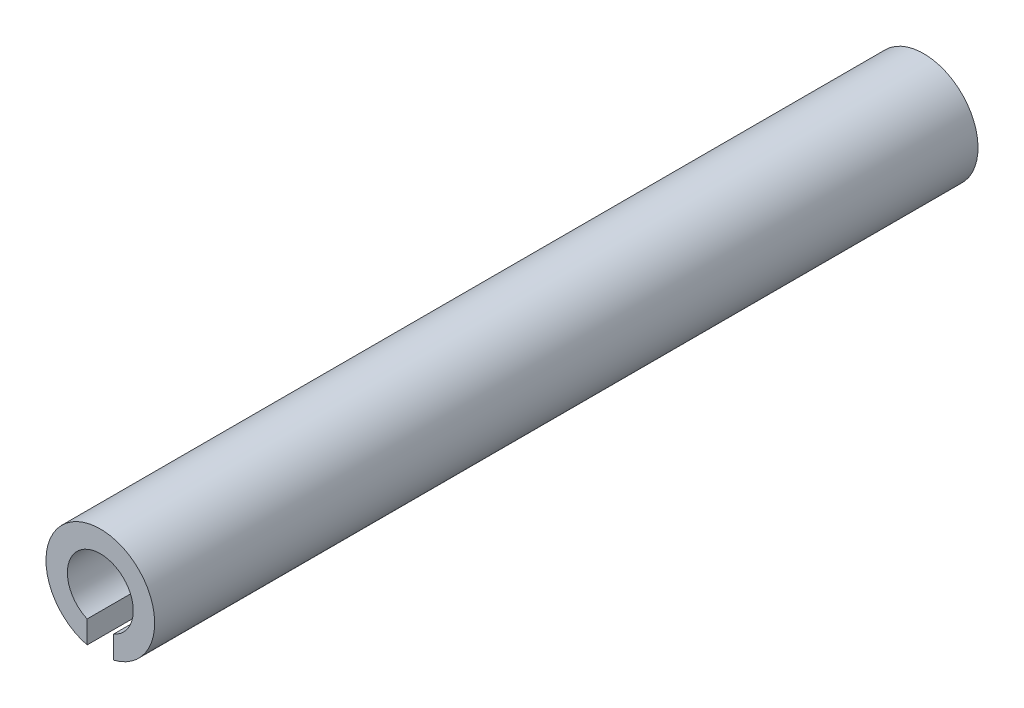
ISO-10303-21;
HEADER;
FILE_DESCRIPTION(('STEP AP214'),'2;1');
FILE_NAME('part.step','',(''),(''),'','','');
FILE_SCHEMA(('AUTOMOTIVE_DESIGN { 1 0 10303 214 1 1 1 1 }'));
ENDSEC;
DATA;
#1=APPLICATION_CONTEXT('core data for automotive mechanical design processes');
#2=APPLICATION_PROTOCOL_DEFINITION('international standard','automotive_design',2000,#1);
#3=PRODUCT_CONTEXT('',#1,'mechanical');
#4=PRODUCT('Part','Part','',(#3));
#5=PRODUCT_RELATED_PRODUCT_CATEGORY('part','',(#4));
#6=PRODUCT_DEFINITION_FORMATION('','',#4);
#7=PRODUCT_DEFINITION_CONTEXT('part definition',#1,'design');
#8=PRODUCT_DEFINITION('design','',#6,#7);
#9=PRODUCT_DEFINITION_SHAPE('','',#8);
#10=(LENGTH_UNIT() NAMED_UNIT(*) SI_UNIT(.MILLI.,.METRE.));
#11=(NAMED_UNIT(*) PLANE_ANGLE_UNIT() SI_UNIT($,.RADIAN.));
#12=(NAMED_UNIT(*) SI_UNIT($,.STERADIAN.) SOLID_ANGLE_UNIT());
#13=UNCERTAINTY_MEASURE_WITH_UNIT(LENGTH_MEASURE(1.E-05),#10,'distance_accuracy_value','');
#14=(GEOMETRIC_REPRESENTATION_CONTEXT(3) GLOBAL_UNCERTAINTY_ASSIGNED_CONTEXT((#13)) GLOBAL_UNIT_ASSIGNED_CONTEXT((#10,
#11,#12)) REPRESENTATION_CONTEXT('',''));
#15=CARTESIAN_POINT('',(0.,0.,0.));
#16=DIRECTION('',(0.,0.,1.));
#17=DIRECTION('',(1.,0.,0.));
#18=AXIS2_PLACEMENT_3D('',#15,#16,#17);
#19=CARTESIAN_POINT('',(0.,0.,25.));
#20=DIRECTION('',(0.,0.,-1.));
#21=DIRECTION('',(-1.,0.,0.));
#22=AXIS2_PLACEMENT_3D('',#19,#20,#21);
#23=CYLINDRICAL_SURFACE('',#22,1.);
#24=CARTESIAN_POINT('',(0.,0.,0.));
#25=DIRECTION('',(0.,0.,1.));
#26=DIRECTION('',(1.,0.,0.));
#27=AXIS2_PLACEMENT_3D('',#24,#25,#26);
#28=CIRCLE('',#27,1.);
#29=CARTESIAN_POINT('',(0.4,-0.916515138991168,0.));
#30=VERTEX_POINT('',#29);
#31=CARTESIAN_POINT('',(-0.4,-0.916515138991168,0.));
#32=VERTEX_POINT('',#31);
#33=EDGE_CURVE('E113',#30,#32,#28,.T.);
#34=ORIENTED_EDGE('',*,*,#33,.F.);
#35=DIRECTION('',(0.,0.,-1.));
#36=VECTOR('',#35,1.);
#37=CARTESIAN_POINT('',(0.4,-0.916515138991168,25.));
#38=LINE('',#37,#36);
#39=CARTESIAN_POINT('',(0.4,-0.916515138991168,25.));
#40=VERTEX_POINT('',#39);
#41=EDGE_CURVE('E11',#40,#30,#38,.T.);
#42=ORIENTED_EDGE('',*,*,#41,.F.);
#43=CARTESIAN_POINT('',(0.,0.,25.));
#44=DIRECTION('',(0.,0.,1.));
#45=DIRECTION('',(1.,0.,0.));
#46=AXIS2_PLACEMENT_3D('',#43,#44,#45);
#47=CIRCLE('',#46,1.);
#48=CARTESIAN_POINT('',(-0.4,-0.916515138991168,25.));
#49=VERTEX_POINT('',#48);
#50=EDGE_CURVE('E94',#40,#49,#47,.T.);
#51=ORIENTED_EDGE('',*,*,#50,.T.);
#52=DIRECTION('',(0.,0.,-1.));
#53=VECTOR('',#52,1.);
#54=CARTESIAN_POINT('',(-0.4,-0.916515138991168,25.));
#55=LINE('',#54,#53);
#56=EDGE_CURVE('E62',#49,#32,#55,.T.);
#57=ORIENTED_EDGE('',*,*,#56,.T.);
#58=EDGE_LOOP('',(#34,#42,#51,#57));
#59=FACE_BOUND('',#58,.T.);
#60=ADVANCED_FACE('F45',(#59),#23,.F.);
#61=CARTESIAN_POINT('',(0.4,0.,25.));
#62=DIRECTION('',(1.,0.,0.));
#63=DIRECTION('',(0.,1.,0.));
#64=AXIS2_PLACEMENT_3D('',#61,#62,#63);
#65=PLANE('',#64);
#66=DIRECTION('',(0.,-1.,0.));
#67=VECTOR('',#66,1.);
#68=CARTESIAN_POINT('',(0.4,0.,0.));
#69=LINE('',#68,#67);
#70=CARTESIAN_POINT('',(0.4,-1.60078105935821,0.));
#71=VERTEX_POINT('',#70);
#72=EDGE_CURVE('E101',#30,#71,#69,.T.);
#73=ORIENTED_EDGE('',*,*,#72,.T.);
#74=DIRECTION('',(0.,0.,-1.));
#75=VECTOR('',#74,1.);
#76=CARTESIAN_POINT('',(0.4,-1.60078105935821,25.));
#77=LINE('',#76,#75);
#78=CARTESIAN_POINT('',(0.4,-1.60078105935821,25.));
#79=VERTEX_POINT('',#78);
#80=EDGE_CURVE('E54',#79,#71,#77,.T.);
#81=ORIENTED_EDGE('',*,*,#80,.F.);
#82=DIRECTION('',(0.,-1.,0.));
#83=VECTOR('',#82,1.);
#84=CARTESIAN_POINT('',(0.4,0.,25.));
#85=LINE('',#84,#83);
#86=EDGE_CURVE('E88',#40,#79,#85,.T.);
#87=ORIENTED_EDGE('',*,*,#86,.F.);
#88=ORIENTED_EDGE('',*,*,#41,.T.);
#89=EDGE_LOOP('',(#73,#81,#87,#88));
#90=FACE_BOUND('',#89,.T.);
#91=ADVANCED_FACE('F99',(#90),#65,.F.);
#92=CARTESIAN_POINT('',(0.,0.,25.));
#93=DIRECTION('',(0.,0.,-1.));
#94=DIRECTION('',(-1.,0.,0.));
#95=AXIS2_PLACEMENT_3D('',#92,#93,#94);
#96=CYLINDRICAL_SURFACE('',#95,1.65);
#97=CARTESIAN_POINT('',(0.,0.,0.));
#98=DIRECTION('',(0.,0.,1.));
#99=DIRECTION('',(1.,0.,0.));
#100=AXIS2_PLACEMENT_3D('',#97,#98,#99);
#101=CIRCLE('',#100,1.65);
#102=CARTESIAN_POINT('',(-0.4,-1.60078105935821,0.));
#103=VERTEX_POINT('',#102);
#104=EDGE_CURVE('E118',#71,#103,#101,.T.);
#105=ORIENTED_EDGE('',*,*,#104,.T.);
#106=DIRECTION('',(0.,0.,-1.));
#107=VECTOR('',#106,1.);
#108=CARTESIAN_POINT('',(-0.4,-1.60078105935821,25.));
#109=LINE('',#108,#107);
#110=CARTESIAN_POINT('',(-0.4,-1.60078105935821,25.));
#111=VERTEX_POINT('',#110);
#112=EDGE_CURVE('E76',#111,#103,#109,.T.);
#113=ORIENTED_EDGE('',*,*,#112,.F.);
#114=CARTESIAN_POINT('',(0.,0.,25.));
#115=DIRECTION('',(0.,0.,1.));
#116=DIRECTION('',(1.,0.,0.));
#117=AXIS2_PLACEMENT_3D('',#114,#115,#116);
#118=CIRCLE('',#117,1.65);
#119=EDGE_CURVE('E93',#79,#111,#118,.T.);
#120=ORIENTED_EDGE('',*,*,#119,.F.);
#121=ORIENTED_EDGE('',*,*,#80,.T.);
#122=EDGE_LOOP('',(#105,#113,#120,#121));
#123=FACE_BOUND('',#122,.T.);
#124=ADVANCED_FACE('F105',(#123),#96,.T.);
#125=CARTESIAN_POINT('',(-0.4,0.,25.));
#126=DIRECTION('',(1.,0.,0.));
#127=DIRECTION('',(0.,1.,0.));
#128=AXIS2_PLACEMENT_3D('',#125,#126,#127);
#129=PLANE('',#128);
#130=DIRECTION('',(0.,-1.,0.));
#131=VECTOR('',#130,1.);
#132=CARTESIAN_POINT('',(-0.4,0.,0.));
#133=LINE('',#132,#131);
#134=EDGE_CURVE('E121',#32,#103,#133,.T.);
#135=ORIENTED_EDGE('',*,*,#134,.F.);
#136=ORIENTED_EDGE('',*,*,#56,.F.);
#137=DIRECTION('',(0.,-1.,0.));
#138=VECTOR('',#137,1.);
#139=CARTESIAN_POINT('',(-0.4,0.,25.));
#140=LINE('',#139,#138);
#141=EDGE_CURVE('E107',#49,#111,#140,.T.);
#142=ORIENTED_EDGE('',*,*,#141,.T.);
#143=ORIENTED_EDGE('',*,*,#112,.T.);
#144=EDGE_LOOP('',(#135,#136,#142,#143));
#145=FACE_BOUND('',#144,.T.);
#146=ADVANCED_FACE('F130',(#145),#129,.T.);
#147=CARTESIAN_POINT('',(0.,0.,25.));
#148=DIRECTION('',(0.,0.,1.));
#149=DIRECTION('',(1.,0.,0.));
#150=AXIS2_PLACEMENT_3D('',#147,#148,#149);
#151=PLANE('',#150);
#152=ORIENTED_EDGE('',*,*,#50,.F.);
#153=ORIENTED_EDGE('',*,*,#86,.T.);
#154=ORIENTED_EDGE('',*,*,#119,.T.);
#155=ORIENTED_EDGE('',*,*,#141,.F.);
#156=EDGE_LOOP('',(#152,#153,#154,#155));
#157=FACE_BOUND('',#156,.T.);
#158=ADVANCED_FACE('F90',(#157),#151,.T.);
#159=CARTESIAN_POINT('',(0.,0.,0.));
#160=DIRECTION('',(0.,0.,1.));
#161=DIRECTION('',(1.,0.,0.));
#162=AXIS2_PLACEMENT_3D('',#159,#160,#161);
#163=PLANE('',#162);
#164=ORIENTED_EDGE('',*,*,#33,.T.);
#165=ORIENTED_EDGE('',*,*,#134,.T.);
#166=ORIENTED_EDGE('',*,*,#104,.F.);
#167=ORIENTED_EDGE('',*,*,#72,.F.);
#168=EDGE_LOOP('',(#164,#165,#166,#167));
#169=FACE_BOUND('',#168,.T.);
#170=ADVANCED_FACE('F137',(#169),#163,.F.);
#171=CLOSED_SHELL('',(#60,#91,#124,#146,#158,#170));
#172=MANIFOLD_SOLID_BREP('B2',#171);
#173=ADVANCED_BREP_SHAPE_REPRESENTATION('',(#18,#172),#14);
#174=SHAPE_DEFINITION_REPRESENTATION(#9,#173);
ENDSEC;
END-ISO-10303-21;
